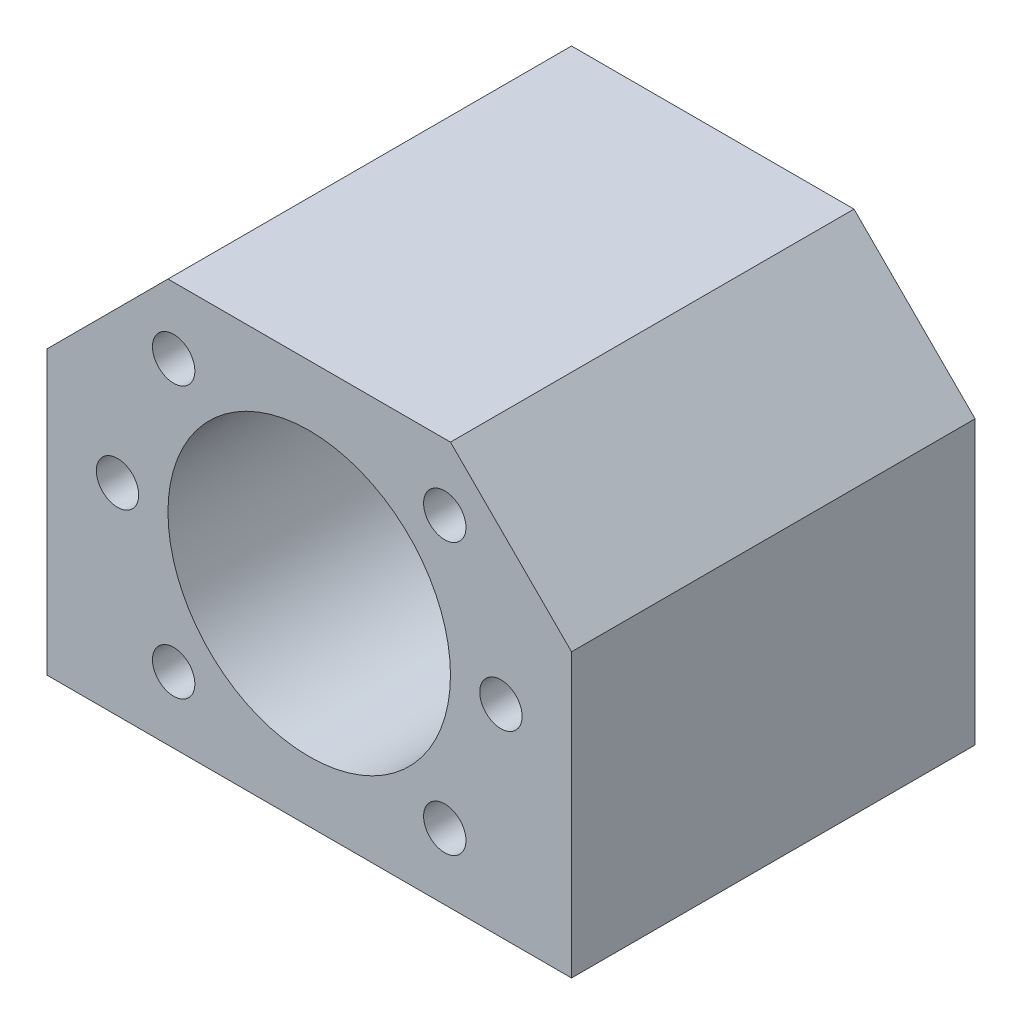
ISO-10303-21;
HEADER;
FILE_DESCRIPTION(('STEP AP214'),'2;1');
FILE_NAME('part.step','',(''),(''),'','','');
FILE_SCHEMA(('AUTOMOTIVE_DESIGN { 1 0 10303 214 1 1 1 1 }'));
ENDSEC;
DATA;
#1=APPLICATION_CONTEXT('core data for automotive mechanical design processes');
#2=APPLICATION_PROTOCOL_DEFINITION('international standard','automotive_design',2000,#1);
#3=PRODUCT_CONTEXT('',#1,'mechanical');
#4=PRODUCT('Part','Part','',(#3));
#5=PRODUCT_RELATED_PRODUCT_CATEGORY('part','',(#4));
#6=PRODUCT_DEFINITION_FORMATION('','',#4);
#7=PRODUCT_DEFINITION_CONTEXT('part definition',#1,'design');
#8=PRODUCT_DEFINITION('design','',#6,#7);
#9=PRODUCT_DEFINITION_SHAPE('','',#8);
#10=(LENGTH_UNIT() NAMED_UNIT(*) SI_UNIT(.MILLI.,.METRE.));
#11=(NAMED_UNIT(*) PLANE_ANGLE_UNIT() SI_UNIT($,.RADIAN.));
#12=(NAMED_UNIT(*) SI_UNIT($,.STERADIAN.) SOLID_ANGLE_UNIT());
#13=UNCERTAINTY_MEASURE_WITH_UNIT(LENGTH_MEASURE(1.E-05),#10,'distance_accuracy_value','');
#14=(GEOMETRIC_REPRESENTATION_CONTEXT(3) GLOBAL_UNCERTAINTY_ASSIGNED_CONTEXT((#13)) GLOBAL_UNIT_ASSIGNED_CONTEXT((#10,
#11,#12)) REPRESENTATION_CONTEXT('',''));
#15=CARTESIAN_POINT('',(0.,0.,0.));
#16=DIRECTION('',(0.,0.,1.));
#17=DIRECTION('',(1.,0.,0.));
#18=AXIS2_PLACEMENT_3D('',#15,#16,#17);
#19=CARTESIAN_POINT('',(0.,0.,40.));
#20=DIRECTION('',(0.,0.,-1.));
#21=DIRECTION('',(-1.,0.,0.));
#22=AXIS2_PLACEMENT_3D('',#19,#20,#21);
#23=PLANE('',#22);
#24=CARTESIAN_POINT('',(13.4350288425444,-13.4350288425444,40.));
#25=DIRECTION('',(0.,0.,1.));
#26=DIRECTION('',(1.,0.,0.));
#27=AXIS2_PLACEMENT_3D('',#24,#25,#26);
#28=CIRCLE('',#27,2.09999999999999);
#29=CARTESIAN_POINT('',(15.5350288425444,-13.4350288425444,40.));
#30=VERTEX_POINT('',#29);
#31=EDGE_CURVE('E289',#30,#30,#28,.T.);
#32=ORIENTED_EDGE('',*,*,#31,.F.);
#33=EDGE_LOOP('',(#32));
#34=FACE_BOUND('',#33,.T.);
#35=CARTESIAN_POINT('',(19.,0.,40.));
#36=DIRECTION('',(0.,0.,1.));
#37=DIRECTION('',(1.,0.,0.));
#38=AXIS2_PLACEMENT_3D('',#35,#36,#37);
#39=CIRCLE('',#38,2.09999999999999);
#40=CARTESIAN_POINT('',(21.1,0.,40.));
#41=VERTEX_POINT('',#40);
#42=EDGE_CURVE('E295',#41,#41,#39,.T.);
#43=ORIENTED_EDGE('',*,*,#42,.F.);
#44=EDGE_LOOP('',(#43));
#45=FACE_BOUND('',#44,.T.);
#46=CARTESIAN_POINT('',(13.4350288425443,13.4350288425445,40.));
#47=DIRECTION('',(0.,0.,1.));
#48=DIRECTION('',(1.,0.,0.));
#49=AXIS2_PLACEMENT_3D('',#46,#47,#48);
#50=CIRCLE('',#49,2.09999999999999);
#51=CARTESIAN_POINT('',(15.5350288425443,13.4350288425445,40.));
#52=VERTEX_POINT('',#51);
#53=EDGE_CURVE('E301',#52,#52,#50,.T.);
#54=ORIENTED_EDGE('',*,*,#53,.F.);
#55=EDGE_LOOP('',(#54));
#56=FACE_BOUND('',#55,.T.);
#57=CARTESIAN_POINT('',(-19.,0.,40.));
#58=DIRECTION('',(0.,0.,1.));
#59=DIRECTION('',(1.,0.,0.));
#60=AXIS2_PLACEMENT_3D('',#57,#58,#59);
#61=CIRCLE('',#60,2.09999999999999);
#62=CARTESIAN_POINT('',(-16.9,0.,40.));
#63=VERTEX_POINT('',#62);
#64=EDGE_CURVE('E307',#63,#63,#61,.T.);
#65=ORIENTED_EDGE('',*,*,#64,.F.);
#66=EDGE_LOOP('',(#65));
#67=FACE_BOUND('',#66,.T.);
#68=CARTESIAN_POINT('',(-13.4350288425443,13.4350288425445,40.));
#69=DIRECTION('',(0.,0.,1.));
#70=DIRECTION('',(1.,0.,0.));
#71=AXIS2_PLACEMENT_3D('',#68,#69,#70);
#72=CIRCLE('',#71,2.09999999999999);
#73=CARTESIAN_POINT('',(-11.3350288425443,13.4350288425445,40.));
#74=VERTEX_POINT('',#73);
#75=EDGE_CURVE('E313',#74,#74,#72,.T.);
#76=ORIENTED_EDGE('',*,*,#75,.F.);
#77=EDGE_LOOP('',(#76));
#78=FACE_BOUND('',#77,.T.);
#79=CARTESIAN_POINT('',(0.,0.,40.));
#80=DIRECTION('',(0.,0.,1.));
#81=DIRECTION('',(1.,0.,0.));
#82=AXIS2_PLACEMENT_3D('',#79,#80,#81);
#83=CIRCLE('',#82,14.);
#84=CARTESIAN_POINT('',(14.,0.,40.));
#85=VERTEX_POINT('',#84);
#86=EDGE_CURVE('E319',#85,#85,#83,.T.);
#87=ORIENTED_EDGE('',*,*,#86,.F.);
#88=EDGE_LOOP('',(#87));
#89=FACE_BOUND('',#88,.T.);
#90=DIRECTION('',(0.,-1.,0.));
#91=VECTOR('',#90,1.);
#92=CARTESIAN_POINT('',(-26.,-20.,40.));
#93=LINE('',#92,#91);
#94=CARTESIAN_POINT('',(-26.,8.,40.));
#95=VERTEX_POINT('',#94);
#96=CARTESIAN_POINT('',(-26.,-20.,40.));
#97=VERTEX_POINT('',#96);
#98=EDGE_CURVE('E139',#95,#97,#93,.T.);
#99=ORIENTED_EDGE('',*,*,#98,.T.);
#100=DIRECTION('',(1.,0.,0.));
#101=VECTOR('',#100,1.);
#102=CARTESIAN_POINT('',(-26.,-20.,40.));
#103=LINE('',#102,#101);
#104=CARTESIAN_POINT('',(26.,-20.,40.));
#105=VERTEX_POINT('',#104);
#106=EDGE_CURVE('E95',#97,#105,#103,.T.);
#107=ORIENTED_EDGE('',*,*,#106,.T.);
#108=DIRECTION('',(0.,1.,0.));
#109=VECTOR('',#108,1.);
#110=CARTESIAN_POINT('',(26.,-20.,40.));
#111=LINE('',#110,#109);
#112=CARTESIAN_POINT('',(26.,8.,40.));
#113=VERTEX_POINT('',#112);
#114=EDGE_CURVE('E110',#105,#113,#111,.T.);
#115=ORIENTED_EDGE('',*,*,#114,.T.);
#116=DIRECTION('',(-0.707106781186548,0.707106781186548,0.));
#117=VECTOR('',#116,1.);
#118=CARTESIAN_POINT('',(26.,8.,40.));
#119=LINE('',#118,#117);
#120=CARTESIAN_POINT('',(14.,20.,40.));
#121=VERTEX_POINT('',#120);
#122=EDGE_CURVE('E104',#113,#121,#119,.T.);
#123=ORIENTED_EDGE('',*,*,#122,.T.);
#124=DIRECTION('',(-1.,0.,0.));
#125=VECTOR('',#124,1.);
#126=CARTESIAN_POINT('',(-14.,20.,40.));
#127=LINE('',#126,#125);
#128=CARTESIAN_POINT('',(-14.,20.,40.));
#129=VERTEX_POINT('',#128);
#130=EDGE_CURVE('E108',#121,#129,#127,.T.);
#131=ORIENTED_EDGE('',*,*,#130,.T.);
#132=DIRECTION('',(-0.707106781186548,-0.707106781186548,0.));
#133=VECTOR('',#132,1.);
#134=CARTESIAN_POINT('',(-26.,8.,40.));
#135=LINE('',#134,#133);
#136=EDGE_CURVE('E57',#129,#95,#135,.T.);
#137=ORIENTED_EDGE('',*,*,#136,.T.);
#138=EDGE_LOOP('',(#99,#107,#115,#123,#131,#137));
#139=FACE_BOUND('',#138,.T.);
#140=CARTESIAN_POINT('',(-13.4350288425443,-13.4350288425445,40.));
#141=DIRECTION('',(0.,0.,1.));
#142=DIRECTION('',(1.,0.,0.));
#143=AXIS2_PLACEMENT_3D('',#140,#141,#142);
#144=CIRCLE('',#143,2.09999999999999);
#145=CARTESIAN_POINT('',(-11.3350288425443,-13.4350288425445,40.));
#146=VERTEX_POINT('',#145);
#147=EDGE_CURVE('E282',#146,#146,#144,.T.);
#148=ORIENTED_EDGE('',*,*,#147,.F.);
#149=EDGE_LOOP('',(#148));
#150=FACE_BOUND('',#149,.T.);
#151=ADVANCED_FACE('F40',(#34,#45,#56,#67,#78,#89,#139,#150),#23,.F.);
#152=CARTESIAN_POINT('',(-26.,-20.,40.));
#153=DIRECTION('',(1.,0.,0.));
#154=DIRECTION('',(0.,0.,-1.));
#155=AXIS2_PLACEMENT_3D('',#152,#153,#154);
#156=PLANE('',#155);
#157=DIRECTION('',(0.,-1.,0.));
#158=VECTOR('',#157,1.);
#159=CARTESIAN_POINT('',(-26.,-20.,0.));
#160=LINE('',#159,#158);
#161=CARTESIAN_POINT('',(-26.,8.,0.));
#162=VERTEX_POINT('',#161);
#163=CARTESIAN_POINT('',(-26.,-20.,0.));
#164=VERTEX_POINT('',#163);
#165=EDGE_CURVE('E128',#162,#164,#160,.T.);
#166=ORIENTED_EDGE('',*,*,#165,.T.);
#167=DIRECTION('',(0.,0.,-1.));
#168=VECTOR('',#167,1.);
#169=CARTESIAN_POINT('',(-26.,-20.,40.));
#170=LINE('',#169,#168);
#171=EDGE_CURVE('E11',#97,#164,#170,.T.);
#172=ORIENTED_EDGE('',*,*,#171,.F.);
#173=ORIENTED_EDGE('',*,*,#98,.F.);
#174=DIRECTION('',(0.,0.,-1.));
#175=VECTOR('',#174,1.);
#176=CARTESIAN_POINT('',(-26.,8.,40.));
#177=LINE('',#176,#175);
#178=EDGE_CURVE('E124',#95,#162,#177,.T.);
#179=ORIENTED_EDGE('',*,*,#178,.T.);
#180=EDGE_LOOP('',(#166,#172,#173,#179));
#181=FACE_BOUND('',#180,.T.);
#182=ADVANCED_FACE('F42',(#181),#156,.F.);
#183=CARTESIAN_POINT('',(-26.,-20.,40.));
#184=DIRECTION('',(0.,1.,0.));
#185=DIRECTION('',(0.,0.,1.));
#186=AXIS2_PLACEMENT_3D('',#183,#184,#185);
#187=PLANE('',#186);
#188=CARTESIAN_POINT('',(20.,-20.,8.));
#189=DIRECTION('',(0.,1.,0.));
#190=DIRECTION('',(0.,0.,1.));
#191=AXIS2_PLACEMENT_3D('',#188,#189,#190);
#192=CIRCLE('',#191,2.1);
#193=CARTESIAN_POINT('',(20.,-20.,10.1));
#194=VERTEX_POINT('',#193);
#195=EDGE_CURVE('E278',#194,#194,#192,.T.);
#196=ORIENTED_EDGE('',*,*,#195,.T.);
#197=EDGE_LOOP('',(#196));
#198=FACE_BOUND('',#197,.T.);
#199=CARTESIAN_POINT('',(-20.,-20.,8.));
#200=DIRECTION('',(0.,1.,0.));
#201=DIRECTION('',(0.,0.,1.));
#202=AXIS2_PLACEMENT_3D('',#199,#200,#201);
#203=CIRCLE('',#202,2.1);
#204=CARTESIAN_POINT('',(-20.,-20.,10.1));
#205=VERTEX_POINT('',#204);
#206=EDGE_CURVE('E272',#205,#205,#203,.T.);
#207=ORIENTED_EDGE('',*,*,#206,.T.);
#208=EDGE_LOOP('',(#207));
#209=FACE_BOUND('',#208,.T.);
#210=CARTESIAN_POINT('',(-20.,-20.,32.));
#211=DIRECTION('',(0.,1.,0.));
#212=DIRECTION('',(0.,0.,1.));
#213=AXIS2_PLACEMENT_3D('',#210,#211,#212);
#214=CIRCLE('',#213,2.1);
#215=CARTESIAN_POINT('',(-20.,-20.,34.1));
#216=VERTEX_POINT('',#215);
#217=EDGE_CURVE('E261',#216,#216,#214,.T.);
#218=ORIENTED_EDGE('',*,*,#217,.T.);
#219=EDGE_LOOP('',(#218));
#220=FACE_BOUND('',#219,.T.);
#221=CARTESIAN_POINT('',(20.,-20.,32.));
#222=DIRECTION('',(0.,1.,0.));
#223=DIRECTION('',(0.,0.,1.));
#224=AXIS2_PLACEMENT_3D('',#221,#222,#223);
#225=CIRCLE('',#224,2.1);
#226=CARTESIAN_POINT('',(20.,-20.,34.1));
#227=VERTEX_POINT('',#226);
#228=EDGE_CURVE('E260',#227,#227,#225,.T.);
#229=ORIENTED_EDGE('',*,*,#228,.T.);
#230=EDGE_LOOP('',(#229));
#231=FACE_BOUND('',#230,.T.);
#232=DIRECTION('',(1.,0.,0.));
#233=VECTOR('',#232,1.);
#234=CARTESIAN_POINT('',(-26.,-20.,0.));
#235=LINE('',#234,#233);
#236=CARTESIAN_POINT('',(26.,-20.,0.));
#237=VERTEX_POINT('',#236);
#238=EDGE_CURVE('E131',#164,#237,#235,.T.);
#239=ORIENTED_EDGE('',*,*,#238,.T.);
#240=DIRECTION('',(0.,0.,-1.));
#241=VECTOR('',#240,1.);
#242=CARTESIAN_POINT('',(26.,-20.,40.));
#243=LINE('',#242,#241);
#244=EDGE_CURVE('E49',#105,#237,#243,.T.);
#245=ORIENTED_EDGE('',*,*,#244,.F.);
#246=ORIENTED_EDGE('',*,*,#106,.F.);
#247=ORIENTED_EDGE('',*,*,#171,.T.);
#248=EDGE_LOOP('',(#239,#245,#246,#247));
#249=FACE_BOUND('',#248,.T.);
#250=ADVANCED_FACE('F169',(#198,#209,#220,#231,#249),#187,.F.);
#251=CARTESIAN_POINT('',(26.,-20.,40.));
#252=DIRECTION('',(-1.,0.,0.));
#253=DIRECTION('',(0.,0.,1.));
#254=AXIS2_PLACEMENT_3D('',#251,#252,#253);
#255=PLANE('',#254);
#256=DIRECTION('',(0.,1.,0.));
#257=VECTOR('',#256,1.);
#258=CARTESIAN_POINT('',(26.,-20.,0.));
#259=LINE('',#258,#257);
#260=CARTESIAN_POINT('',(26.,8.,0.));
#261=VERTEX_POINT('',#260);
#262=EDGE_CURVE('E134',#237,#261,#259,.T.);
#263=ORIENTED_EDGE('',*,*,#262,.T.);
#264=DIRECTION('',(0.,0.,-1.));
#265=VECTOR('',#264,1.);
#266=CARTESIAN_POINT('',(26.,8.,40.));
#267=LINE('',#266,#265);
#268=EDGE_CURVE('E119',#113,#261,#267,.T.);
#269=ORIENTED_EDGE('',*,*,#268,.F.);
#270=ORIENTED_EDGE('',*,*,#114,.F.);
#271=ORIENTED_EDGE('',*,*,#244,.T.);
#272=EDGE_LOOP('',(#263,#269,#270,#271));
#273=FACE_BOUND('',#272,.T.);
#274=ADVANCED_FACE('F145',(#273),#255,.F.);
#275=CARTESIAN_POINT('',(26.,8.,40.));
#276=DIRECTION('',(-0.707106781186548,-0.707106781186548,0.));
#277=DIRECTION('',(0.707106781186548,-0.707106781186548,0.));
#278=AXIS2_PLACEMENT_3D('',#275,#276,#277);
#279=PLANE('',#278);
#280=DIRECTION('',(-0.707106781186548,0.707106781186548,0.));
#281=VECTOR('',#280,1.);
#282=CARTESIAN_POINT('',(26.,8.,0.));
#283=LINE('',#282,#281);
#284=CARTESIAN_POINT('',(14.,20.,0.));
#285=VERTEX_POINT('',#284);
#286=EDGE_CURVE('E118',#261,#285,#283,.T.);
#287=ORIENTED_EDGE('',*,*,#286,.T.);
#288=DIRECTION('',(0.,0.,-1.));
#289=VECTOR('',#288,1.);
#290=CARTESIAN_POINT('',(14.,20.,40.));
#291=LINE('',#290,#289);
#292=EDGE_CURVE('E115',#121,#285,#291,.T.);
#293=ORIENTED_EDGE('',*,*,#292,.F.);
#294=ORIENTED_EDGE('',*,*,#122,.F.);
#295=ORIENTED_EDGE('',*,*,#268,.T.);
#296=EDGE_LOOP('',(#287,#293,#294,#295));
#297=FACE_BOUND('',#296,.T.);
#298=ADVANCED_FACE('F116',(#297),#279,.F.);
#299=CARTESIAN_POINT('',(-14.,20.,40.));
#300=DIRECTION('',(0.,-1.,0.));
#301=DIRECTION('',(0.,0.,-1.));
#302=AXIS2_PLACEMENT_3D('',#299,#300,#301);
#303=PLANE('',#302);
#304=DIRECTION('',(-1.,0.,0.));
#305=VECTOR('',#304,1.);
#306=CARTESIAN_POINT('',(-14.,20.,0.));
#307=LINE('',#306,#305);
#308=CARTESIAN_POINT('',(-14.,20.,0.));
#309=VERTEX_POINT('',#308);
#310=EDGE_CURVE('E81',#285,#309,#307,.T.);
#311=ORIENTED_EDGE('',*,*,#310,.T.);
#312=DIRECTION('',(0.,0.,-1.));
#313=VECTOR('',#312,1.);
#314=CARTESIAN_POINT('',(-14.,20.,40.));
#315=LINE('',#314,#313);
#316=EDGE_CURVE('E120',#129,#309,#315,.T.);
#317=ORIENTED_EDGE('',*,*,#316,.F.);
#318=ORIENTED_EDGE('',*,*,#130,.F.);
#319=ORIENTED_EDGE('',*,*,#292,.T.);
#320=EDGE_LOOP('',(#311,#317,#318,#319));
#321=FACE_BOUND('',#320,.T.);
#322=ADVANCED_FACE('F122',(#321),#303,.F.);
#323=CARTESIAN_POINT('',(-26.,8.,40.));
#324=DIRECTION('',(0.707106781186548,-0.707106781186548,0.));
#325=DIRECTION('',(0.707106781186548,0.707106781186548,0.));
#326=AXIS2_PLACEMENT_3D('',#323,#324,#325);
#327=PLANE('',#326);
#328=DIRECTION('',(-0.707106781186548,-0.707106781186548,0.));
#329=VECTOR('',#328,1.);
#330=CARTESIAN_POINT('',(-26.,8.,0.));
#331=LINE('',#330,#329);
#332=EDGE_CURVE('E87',#309,#162,#331,.T.);
#333=ORIENTED_EDGE('',*,*,#332,.T.);
#334=ORIENTED_EDGE('',*,*,#178,.F.);
#335=ORIENTED_EDGE('',*,*,#136,.F.);
#336=ORIENTED_EDGE('',*,*,#316,.T.);
#337=EDGE_LOOP('',(#333,#334,#335,#336));
#338=FACE_BOUND('',#337,.T.);
#339=ADVANCED_FACE('F152',(#338),#327,.F.);
#340=CARTESIAN_POINT('',(0.,0.,0.));
#341=DIRECTION('',(0.,0.,-1.));
#342=DIRECTION('',(-1.,0.,0.));
#343=AXIS2_PLACEMENT_3D('',#340,#341,#342);
#344=PLANE('',#343);
#345=CARTESIAN_POINT('',(0.,0.,0.));
#346=DIRECTION('',(0.,0.,1.));
#347=DIRECTION('',(1.,0.,0.));
#348=AXIS2_PLACEMENT_3D('',#345,#346,#347);
#349=CIRCLE('',#348,14.);
#350=CARTESIAN_POINT('',(14.,0.,0.));
#351=VERTEX_POINT('',#350);
#352=EDGE_CURVE('E132',#351,#351,#349,.T.);
#353=ORIENTED_EDGE('',*,*,#352,.T.);
#354=EDGE_LOOP('',(#353));
#355=FACE_BOUND('',#354,.T.);
#356=ORIENTED_EDGE('',*,*,#165,.F.);
#357=ORIENTED_EDGE('',*,*,#332,.F.);
#358=ORIENTED_EDGE('',*,*,#310,.F.);
#359=ORIENTED_EDGE('',*,*,#286,.F.);
#360=ORIENTED_EDGE('',*,*,#262,.F.);
#361=ORIENTED_EDGE('',*,*,#238,.F.);
#362=EDGE_LOOP('',(#356,#357,#358,#359,#360,#361));
#363=FACE_BOUND('',#362,.T.);
#364=ADVANCED_FACE('F148',(#355,#363),#344,.T.);
#365=CARTESIAN_POINT('',(0.,0.,0.));
#366=DIRECTION('',(0.,0.,1.));
#367=DIRECTION('',(1.,0.,0.));
#368=AXIS2_PLACEMENT_3D('',#365,#366,#367);
#369=CYLINDRICAL_SURFACE('',#368,14.);
#370=ORIENTED_EDGE('',*,*,#352,.F.);
#371=EDGE_LOOP('',(#370));
#372=FACE_BOUND('',#371,.T.);
#373=ORIENTED_EDGE('',*,*,#86,.T.);
#374=EDGE_LOOP('',(#373));
#375=FACE_BOUND('',#374,.T.);
#376=ADVANCED_FACE('F159',(#372,#375),#369,.F.);
#377=CARTESIAN_POINT('',(-13.4350288425443,13.4350288425445,25.));
#378=DIRECTION('',(0.,0.,1.));
#379=DIRECTION('',(1.,0.,0.));
#380=AXIS2_PLACEMENT_3D('',#377,#378,#379);
#381=CONICAL_SURFACE('',#380,2.09999999999999,1.02974425867665);
#382=CARTESIAN_POINT('',(-13.4350288425443,13.4350288425445,23.7381927000421));
#383=VERTEX_POINT('',#382);
#384=VERTEX_LOOP('',#383);
#385=FACE_BOUND('',#384,.T.);
#386=CARTESIAN_POINT('',(-13.4350288425443,13.4350288425445,25.));
#387=DIRECTION('',(0.,0.,1.));
#388=DIRECTION('',(1.,0.,0.));
#389=AXIS2_PLACEMENT_3D('',#386,#387,#388);
#390=CIRCLE('',#389,2.09999999999999);
#391=CARTESIAN_POINT('',(-11.3350288425443,13.4350288425445,25.));
#392=VERTEX_POINT('',#391);
#393=EDGE_CURVE('E316',#392,#392,#390,.T.);
#394=ORIENTED_EDGE('',*,*,#393,.T.);
#395=EDGE_LOOP('',(#394));
#396=FACE_BOUND('',#395,.T.);
#397=ADVANCED_FACE('F175',(#385,#396),#381,.F.);
#398=CARTESIAN_POINT('',(-13.4350288425443,13.4350288425445,40.));
#399=DIRECTION('',(0.,0.,1.));
#400=DIRECTION('',(1.,0.,0.));
#401=AXIS2_PLACEMENT_3D('',#398,#399,#400);
#402=CYLINDRICAL_SURFACE('',#401,2.09999999999999);
#403=ORIENTED_EDGE('',*,*,#393,.F.);
#404=EDGE_LOOP('',(#403));
#405=FACE_BOUND('',#404,.T.);
#406=ORIENTED_EDGE('',*,*,#75,.T.);
#407=EDGE_LOOP('',(#406));
#408=FACE_BOUND('',#407,.T.);
#409=ADVANCED_FACE('F179',(#405,#408),#402,.F.);
#410=CARTESIAN_POINT('',(-19.,0.,25.));
#411=DIRECTION('',(0.,0.,1.));
#412=DIRECTION('',(1.,0.,0.));
#413=AXIS2_PLACEMENT_3D('',#410,#411,#412);
#414=CONICAL_SURFACE('',#413,2.09999999999999,1.02974425867665);
#415=CARTESIAN_POINT('',(-19.,0.,23.7381927000421));
#416=VERTEX_POINT('',#415);
#417=VERTEX_LOOP('',#416);
#418=FACE_BOUND('',#417,.T.);
#419=CARTESIAN_POINT('',(-19.,0.,25.));
#420=DIRECTION('',(0.,0.,1.));
#421=DIRECTION('',(1.,0.,0.));
#422=AXIS2_PLACEMENT_3D('',#419,#420,#421);
#423=CIRCLE('',#422,2.09999999999999);
#424=CARTESIAN_POINT('',(-16.9,0.,25.));
#425=VERTEX_POINT('',#424);
#426=EDGE_CURVE('E310',#425,#425,#423,.T.);
#427=ORIENTED_EDGE('',*,*,#426,.T.);
#428=EDGE_LOOP('',(#427));
#429=FACE_BOUND('',#428,.T.);
#430=ADVANCED_FACE('F183',(#418,#429),#414,.F.);
#431=CARTESIAN_POINT('',(-19.,0.,40.));
#432=DIRECTION('',(0.,0.,1.));
#433=DIRECTION('',(1.,0.,0.));
#434=AXIS2_PLACEMENT_3D('',#431,#432,#433);
#435=CYLINDRICAL_SURFACE('',#434,2.09999999999999);
#436=ORIENTED_EDGE('',*,*,#426,.F.);
#437=EDGE_LOOP('',(#436));
#438=FACE_BOUND('',#437,.T.);
#439=ORIENTED_EDGE('',*,*,#64,.T.);
#440=EDGE_LOOP('',(#439));
#441=FACE_BOUND('',#440,.T.);
#442=ADVANCED_FACE('F187',(#438,#441),#435,.F.);
#443=CARTESIAN_POINT('',(13.4350288425443,13.4350288425445,25.));
#444=DIRECTION('',(0.,0.,1.));
#445=DIRECTION('',(1.,0.,0.));
#446=AXIS2_PLACEMENT_3D('',#443,#444,#445);
#447=CONICAL_SURFACE('',#446,2.09999999999999,1.02974425867665);
#448=CARTESIAN_POINT('',(13.4350288425443,13.4350288425445,23.7381927000421));
#449=VERTEX_POINT('',#448);
#450=VERTEX_LOOP('',#449);
#451=FACE_BOUND('',#450,.T.);
#452=CARTESIAN_POINT('',(13.4350288425443,13.4350288425445,25.));
#453=DIRECTION('',(0.,0.,1.));
#454=DIRECTION('',(1.,0.,0.));
#455=AXIS2_PLACEMENT_3D('',#452,#453,#454);
#456=CIRCLE('',#455,2.09999999999999);
#457=CARTESIAN_POINT('',(15.5350288425443,13.4350288425445,25.));
#458=VERTEX_POINT('',#457);
#459=EDGE_CURVE('E304',#458,#458,#456,.T.);
#460=ORIENTED_EDGE('',*,*,#459,.T.);
#461=EDGE_LOOP('',(#460));
#462=FACE_BOUND('',#461,.T.);
#463=ADVANCED_FACE('F191',(#451,#462),#447,.F.);
#464=CARTESIAN_POINT('',(13.4350288425443,13.4350288425445,40.));
#465=DIRECTION('',(0.,0.,1.));
#466=DIRECTION('',(1.,0.,0.));
#467=AXIS2_PLACEMENT_3D('',#464,#465,#466);
#468=CYLINDRICAL_SURFACE('',#467,2.09999999999999);
#469=ORIENTED_EDGE('',*,*,#459,.F.);
#470=EDGE_LOOP('',(#469));
#471=FACE_BOUND('',#470,.T.);
#472=ORIENTED_EDGE('',*,*,#53,.T.);
#473=EDGE_LOOP('',(#472));
#474=FACE_BOUND('',#473,.T.);
#475=ADVANCED_FACE('F195',(#471,#474),#468,.F.);
#476=CARTESIAN_POINT('',(19.,0.,25.));
#477=DIRECTION('',(0.,0.,1.));
#478=DIRECTION('',(1.,0.,0.));
#479=AXIS2_PLACEMENT_3D('',#476,#477,#478);
#480=CONICAL_SURFACE('',#479,2.09999999999999,1.02974425867665);
#481=CARTESIAN_POINT('',(19.,0.,23.7381927000421));
#482=VERTEX_POINT('',#481);
#483=VERTEX_LOOP('',#482);
#484=FACE_BOUND('',#483,.T.);
#485=CARTESIAN_POINT('',(19.,0.,25.));
#486=DIRECTION('',(0.,0.,1.));
#487=DIRECTION('',(1.,0.,0.));
#488=AXIS2_PLACEMENT_3D('',#485,#486,#487);
#489=CIRCLE('',#488,2.09999999999999);
#490=CARTESIAN_POINT('',(21.1,0.,25.));
#491=VERTEX_POINT('',#490);
#492=EDGE_CURVE('E298',#491,#491,#489,.T.);
#493=ORIENTED_EDGE('',*,*,#492,.T.);
#494=EDGE_LOOP('',(#493));
#495=FACE_BOUND('',#494,.T.);
#496=ADVANCED_FACE('F199',(#484,#495),#480,.F.);
#497=CARTESIAN_POINT('',(19.,0.,40.));
#498=DIRECTION('',(0.,0.,1.));
#499=DIRECTION('',(1.,0.,0.));
#500=AXIS2_PLACEMENT_3D('',#497,#498,#499);
#501=CYLINDRICAL_SURFACE('',#500,2.09999999999999);
#502=ORIENTED_EDGE('',*,*,#492,.F.);
#503=EDGE_LOOP('',(#502));
#504=FACE_BOUND('',#503,.T.);
#505=ORIENTED_EDGE('',*,*,#42,.T.);
#506=EDGE_LOOP('',(#505));
#507=FACE_BOUND('',#506,.T.);
#508=ADVANCED_FACE('F203',(#504,#507),#501,.F.);
#509=CARTESIAN_POINT('',(13.4350288425444,-13.4350288425444,25.));
#510=DIRECTION('',(0.,0.,1.));
#511=DIRECTION('',(1.,0.,0.));
#512=AXIS2_PLACEMENT_3D('',#509,#510,#511);
#513=CONICAL_SURFACE('',#512,2.09999999999999,1.02974425867665);
#514=CARTESIAN_POINT('',(13.4350288425444,-13.4350288425444,23.7381927000421));
#515=VERTEX_POINT('',#514);
#516=VERTEX_LOOP('',#515);
#517=FACE_BOUND('',#516,.T.);
#518=CARTESIAN_POINT('',(13.4350288425444,-13.4350288425444,25.));
#519=DIRECTION('',(0.,0.,1.));
#520=DIRECTION('',(1.,0.,0.));
#521=AXIS2_PLACEMENT_3D('',#518,#519,#520);
#522=CIRCLE('',#521,2.09999999999999);
#523=CARTESIAN_POINT('',(15.5350288425444,-13.4350288425444,25.));
#524=VERTEX_POINT('',#523);
#525=EDGE_CURVE('E292',#524,#524,#522,.T.);
#526=ORIENTED_EDGE('',*,*,#525,.T.);
#527=EDGE_LOOP('',(#526));
#528=FACE_BOUND('',#527,.T.);
#529=ADVANCED_FACE('F207',(#517,#528),#513,.F.);
#530=CARTESIAN_POINT('',(13.4350288425444,-13.4350288425444,40.));
#531=DIRECTION('',(0.,0.,1.));
#532=DIRECTION('',(1.,0.,0.));
#533=AXIS2_PLACEMENT_3D('',#530,#531,#532);
#534=CYLINDRICAL_SURFACE('',#533,2.09999999999999);
#535=ORIENTED_EDGE('',*,*,#525,.F.);
#536=EDGE_LOOP('',(#535));
#537=FACE_BOUND('',#536,.T.);
#538=ORIENTED_EDGE('',*,*,#31,.T.);
#539=EDGE_LOOP('',(#538));
#540=FACE_BOUND('',#539,.T.);
#541=ADVANCED_FACE('F211',(#537,#540),#534,.F.);
#542=CARTESIAN_POINT('',(-13.4350288425443,-13.4350288425445,25.));
#543=DIRECTION('',(0.,0.,1.));
#544=DIRECTION('',(1.,0.,0.));
#545=AXIS2_PLACEMENT_3D('',#542,#543,#544);
#546=CONICAL_SURFACE('',#545,2.09999999999999,1.02974425867665);
#547=CARTESIAN_POINT('',(-13.4350288425443,-13.4350288425445,23.7381927000421));
#548=VERTEX_POINT('',#547);
#549=VERTEX_LOOP('',#548);
#550=FACE_BOUND('',#549,.T.);
#551=CARTESIAN_POINT('',(-13.4350288425443,-13.4350288425445,25.));
#552=DIRECTION('',(0.,0.,1.));
#553=DIRECTION('',(1.,0.,0.));
#554=AXIS2_PLACEMENT_3D('',#551,#552,#553);
#555=CIRCLE('',#554,2.09999999999999);
#556=CARTESIAN_POINT('',(-11.3350288425443,-13.4350288425445,25.));
#557=VERTEX_POINT('',#556);
#558=EDGE_CURVE('E286',#557,#557,#555,.T.);
#559=ORIENTED_EDGE('',*,*,#558,.T.);
#560=EDGE_LOOP('',(#559));
#561=FACE_BOUND('',#560,.T.);
#562=ADVANCED_FACE('F215',(#550,#561),#546,.F.);
#563=CARTESIAN_POINT('',(-13.4350288425443,-13.4350288425445,40.));
#564=DIRECTION('',(0.,0.,1.));
#565=DIRECTION('',(1.,0.,0.));
#566=AXIS2_PLACEMENT_3D('',#563,#564,#565);
#567=CYLINDRICAL_SURFACE('',#566,2.09999999999999);
#568=ORIENTED_EDGE('',*,*,#558,.F.);
#569=EDGE_LOOP('',(#568));
#570=FACE_BOUND('',#569,.T.);
#571=ORIENTED_EDGE('',*,*,#147,.T.);
#572=EDGE_LOOP('',(#571));
#573=FACE_BOUND('',#572,.T.);
#574=ADVANCED_FACE('F219',(#570,#573),#567,.F.);
#575=CARTESIAN_POINT('',(20.,-5.,32.));
#576=DIRECTION('',(0.,-1.,0.));
#577=DIRECTION('',(0.,0.,-1.));
#578=AXIS2_PLACEMENT_3D('',#575,#576,#577);
#579=CYLINDRICAL_SURFACE('',#578,2.1);
#580=CARTESIAN_POINT('',(20.,-5.,32.));
#581=DIRECTION('',(0.,1.,0.));
#582=DIRECTION('',(0.,0.,1.));
#583=AXIS2_PLACEMENT_3D('',#580,#581,#582);
#584=CIRCLE('',#583,2.1);
#585=CARTESIAN_POINT('',(20.,-5.,34.1));
#586=VERTEX_POINT('',#585);
#587=EDGE_CURVE('E264',#586,#586,#584,.T.);
#588=ORIENTED_EDGE('',*,*,#587,.T.);
#589=EDGE_LOOP('',(#588));
#590=FACE_BOUND('',#589,.T.);
#591=ORIENTED_EDGE('',*,*,#228,.F.);
#592=EDGE_LOOP('',(#591));
#593=FACE_BOUND('',#592,.T.);
#594=ADVANCED_FACE('F223',(#590,#593),#579,.F.);
#595=CARTESIAN_POINT('',(20.,-5.,32.));
#596=DIRECTION('',(0.,1.,0.));
#597=DIRECTION('',(0.,0.,1.));
#598=AXIS2_PLACEMENT_3D('',#595,#596,#597);
#599=PLANE('',#598);
#600=ORIENTED_EDGE('',*,*,#587,.F.);
#601=EDGE_LOOP('',(#600));
#602=FACE_BOUND('',#601,.T.);
#603=ADVANCED_FACE('F227',(#602),#599,.F.);
#604=CARTESIAN_POINT('',(-20.,-5.,32.));
#605=DIRECTION('',(0.,-1.,0.));
#606=DIRECTION('',(0.,0.,-1.));
#607=AXIS2_PLACEMENT_3D('',#604,#605,#606);
#608=CYLINDRICAL_SURFACE('',#607,2.1);
#609=CARTESIAN_POINT('',(-20.,-5.,32.));
#610=DIRECTION('',(0.,1.,0.));
#611=DIRECTION('',(0.,0.,1.));
#612=AXIS2_PLACEMENT_3D('',#609,#610,#611);
#613=CIRCLE('',#612,2.1);
#614=CARTESIAN_POINT('',(-20.,-5.,34.1));
#615=VERTEX_POINT('',#614);
#616=EDGE_CURVE('E259',#615,#615,#613,.T.);
#617=ORIENTED_EDGE('',*,*,#616,.T.);
#618=EDGE_LOOP('',(#617));
#619=FACE_BOUND('',#618,.T.);
#620=ORIENTED_EDGE('',*,*,#217,.F.);
#621=EDGE_LOOP('',(#620));
#622=FACE_BOUND('',#621,.T.);
#623=ADVANCED_FACE('F231',(#619,#622),#608,.F.);
#624=CARTESIAN_POINT('',(-20.,-5.,32.));
#625=DIRECTION('',(0.,1.,0.));
#626=DIRECTION('',(0.,0.,1.));
#627=AXIS2_PLACEMENT_3D('',#624,#625,#626);
#628=PLANE('',#627);
#629=ORIENTED_EDGE('',*,*,#616,.F.);
#630=EDGE_LOOP('',(#629));
#631=FACE_BOUND('',#630,.T.);
#632=ADVANCED_FACE('F245',(#631),#628,.F.);
#633=CARTESIAN_POINT('',(-20.,-5.,8.));
#634=DIRECTION('',(0.,-1.,0.));
#635=DIRECTION('',(0.,0.,-1.));
#636=AXIS2_PLACEMENT_3D('',#633,#634,#635);
#637=CYLINDRICAL_SURFACE('',#636,2.1);
#638=CARTESIAN_POINT('',(-20.,-5.,8.));
#639=DIRECTION('',(0.,1.,0.));
#640=DIRECTION('',(0.,0.,1.));
#641=AXIS2_PLACEMENT_3D('',#638,#639,#640);
#642=CIRCLE('',#641,2.1);
#643=CARTESIAN_POINT('',(-20.,-5.,10.1));
#644=VERTEX_POINT('',#643);
#645=EDGE_CURVE('E267',#644,#644,#642,.T.);
#646=ORIENTED_EDGE('',*,*,#645,.T.);
#647=EDGE_LOOP('',(#646));
#648=FACE_BOUND('',#647,.T.);
#649=ORIENTED_EDGE('',*,*,#206,.F.);
#650=EDGE_LOOP('',(#649));
#651=FACE_BOUND('',#650,.T.);
#652=ADVANCED_FACE('F242',(#648,#651),#637,.F.);
#653=CARTESIAN_POINT('',(-20.,-5.,8.));
#654=DIRECTION('',(0.,1.,0.));
#655=DIRECTION('',(0.,0.,1.));
#656=AXIS2_PLACEMENT_3D('',#653,#654,#655);
#657=PLANE('',#656);
#658=ORIENTED_EDGE('',*,*,#645,.F.);
#659=EDGE_LOOP('',(#658));
#660=FACE_BOUND('',#659,.T.);
#661=ADVANCED_FACE('F237',(#660),#657,.F.);
#662=CARTESIAN_POINT('',(20.,-5.,8.));
#663=DIRECTION('',(0.,-1.,0.));
#664=DIRECTION('',(0.,0.,-1.));
#665=AXIS2_PLACEMENT_3D('',#662,#663,#664);
#666=CYLINDRICAL_SURFACE('',#665,2.1);
#667=CARTESIAN_POINT('',(20.,-5.,8.));
#668=DIRECTION('',(0.,1.,0.));
#669=DIRECTION('',(0.,0.,1.));
#670=AXIS2_PLACEMENT_3D('',#667,#668,#669);
#671=CIRCLE('',#670,2.1);
#672=CARTESIAN_POINT('',(20.,-5.,10.1));
#673=VERTEX_POINT('',#672);
#674=EDGE_CURVE('E275',#673,#673,#671,.T.);
#675=ORIENTED_EDGE('',*,*,#674,.T.);
#676=EDGE_LOOP('',(#675));
#677=FACE_BOUND('',#676,.T.);
#678=ORIENTED_EDGE('',*,*,#195,.F.);
#679=EDGE_LOOP('',(#678));
#680=FACE_BOUND('',#679,.T.);
#681=ADVANCED_FACE('F233',(#677,#680),#666,.F.);
#682=CARTESIAN_POINT('',(20.,-5.,8.));
#683=DIRECTION('',(0.,1.,0.));
#684=DIRECTION('',(0.,0.,1.));
#685=AXIS2_PLACEMENT_3D('',#682,#683,#684);
#686=PLANE('',#685);
#687=ORIENTED_EDGE('',*,*,#674,.F.);
#688=EDGE_LOOP('',(#687));
#689=FACE_BOUND('',#688,.T.);
#690=ADVANCED_FACE('F236',(#689),#686,.F.);
#691=CLOSED_SHELL('',(#151,#182,#250,#274,#298,#322,#339,#364,#376,#397,#409,#430,#442,#463,
#475,#496,#508,#529,#541,#562,#574,#594,#603,#623,#632,#652,#661,#681,#690));
#692=MANIFOLD_SOLID_BREP('B2',#691);
#693=ADVANCED_BREP_SHAPE_REPRESENTATION('',(#18,#692),#14);
#694=SHAPE_DEFINITION_REPRESENTATION(#9,#693);
ENDSEC;
END-ISO-10303-21;
